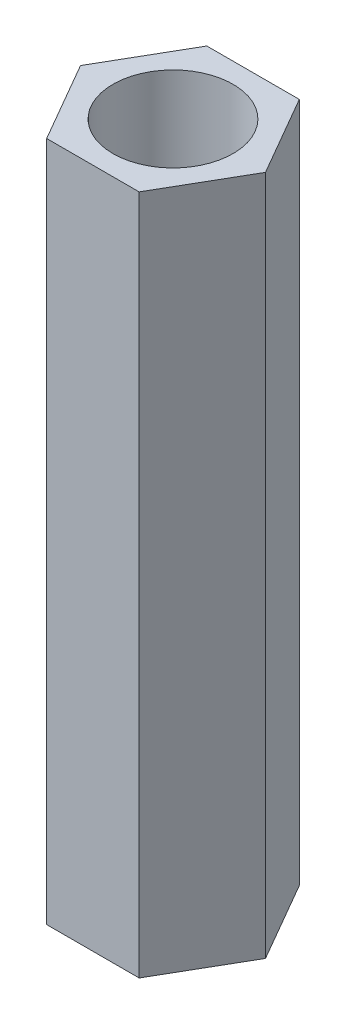
ISO-10303-21;
HEADER;
FILE_DESCRIPTION(('STEP AP214'),'2;1');
FILE_NAME('part.step','',(''),(''),'','','');
FILE_SCHEMA(('AUTOMOTIVE_DESIGN { 1 0 10303 214 1 1 1 1 }'));
ENDSEC;
DATA;
#1=APPLICATION_CONTEXT('core data for automotive mechanical design processes');
#2=APPLICATION_PROTOCOL_DEFINITION('international standard','automotive_design',2000,#1);
#3=PRODUCT_CONTEXT('',#1,'mechanical');
#4=PRODUCT('Part','Part','',(#3));
#5=PRODUCT_RELATED_PRODUCT_CATEGORY('part','',(#4));
#6=PRODUCT_DEFINITION_FORMATION('','',#4);
#7=PRODUCT_DEFINITION_CONTEXT('part definition',#1,'design');
#8=PRODUCT_DEFINITION('design','',#6,#7);
#9=PRODUCT_DEFINITION_SHAPE('','',#8);
#10=(LENGTH_UNIT() NAMED_UNIT(*) SI_UNIT(.MILLI.,.METRE.));
#11=(NAMED_UNIT(*) PLANE_ANGLE_UNIT() SI_UNIT($,.RADIAN.));
#12=(NAMED_UNIT(*) SI_UNIT($,.STERADIAN.) SOLID_ANGLE_UNIT());
#13=UNCERTAINTY_MEASURE_WITH_UNIT(LENGTH_MEASURE(1.E-05),#10,'distance_accuracy_value','');
#14=(GEOMETRIC_REPRESENTATION_CONTEXT(3) GLOBAL_UNCERTAINTY_ASSIGNED_CONTEXT((#13)) GLOBAL_UNIT_ASSIGNED_CONTEXT((#10,
#11,#12)) REPRESENTATION_CONTEXT('',''));
#15=CARTESIAN_POINT('',(0.,0.,0.));
#16=DIRECTION('',(0.,0.,1.));
#17=DIRECTION('',(1.,0.,0.));
#18=AXIS2_PLACEMENT_3D('',#15,#16,#17);
#19=CARTESIAN_POINT('',(0.,8.5,0.));
#20=DIRECTION('',(0.,1.,0.));
#21=DIRECTION('',(0.,0.,1.));
#22=AXIS2_PLACEMENT_3D('',#19,#20,#21);
#23=PLANE('',#22);
#24=DIRECTION('',(-0.5,0.,-0.866025403784438));
#25=VECTOR('',#24,1.);
#26=CARTESIAN_POINT('',(2.3094010767585,8.5,0.));
#27=LINE('',#26,#25);
#28=CARTESIAN_POINT('',(2.3094010767585,8.5,0.));
#29=VERTEX_POINT('',#28);
#30=CARTESIAN_POINT('',(1.15470053837925,8.5,-2.));
#31=VERTEX_POINT('',#30);
#32=EDGE_CURVE('E128',#29,#31,#27,.T.);
#33=ORIENTED_EDGE('',*,*,#32,.T.);
#34=DIRECTION('',(-1.,0.,0.));
#35=VECTOR('',#34,1.);
#36=CARTESIAN_POINT('',(1.15470053837925,8.5,-2.));
#37=LINE('',#36,#35);
#38=CARTESIAN_POINT('',(-1.15470053837925,8.5,-2.));
#39=VERTEX_POINT('',#38);
#40=EDGE_CURVE('E86',#31,#39,#37,.T.);
#41=ORIENTED_EDGE('',*,*,#40,.T.);
#42=DIRECTION('',(-0.5,0.,0.866025403784439));
#43=VECTOR('',#42,1.);
#44=CARTESIAN_POINT('',(-1.15470053837925,8.5,-2.));
#45=LINE('',#44,#43);
#46=CARTESIAN_POINT('',(-2.3094010767585,8.5,0.));
#47=VERTEX_POINT('',#46);
#48=EDGE_CURVE('E99',#39,#47,#45,.T.);
#49=ORIENTED_EDGE('',*,*,#48,.T.);
#50=DIRECTION('',(0.5,0.,0.866025403784438));
#51=VECTOR('',#50,1.);
#52=CARTESIAN_POINT('',(-2.3094010767585,8.5,0.));
#53=LINE('',#52,#51);
#54=CARTESIAN_POINT('',(-1.15470053837925,8.5,2.));
#55=VERTEX_POINT('',#54);
#56=EDGE_CURVE('E93',#47,#55,#53,.T.);
#57=ORIENTED_EDGE('',*,*,#56,.T.);
#58=DIRECTION('',(1.,0.,0.));
#59=VECTOR('',#58,1.);
#60=CARTESIAN_POINT('',(-1.15470053837925,8.5,2.));
#61=LINE('',#60,#59);
#62=CARTESIAN_POINT('',(1.15470053837925,8.5,2.));
#63=VERTEX_POINT('',#62);
#64=EDGE_CURVE('E97',#55,#63,#61,.T.);
#65=ORIENTED_EDGE('',*,*,#64,.T.);
#66=DIRECTION('',(0.5,0.,-0.866025403784439));
#67=VECTOR('',#66,1.);
#68=CARTESIAN_POINT('',(1.15470053837925,8.5,2.));
#69=LINE('',#68,#67);
#70=EDGE_CURVE('E49',#63,#29,#69,.T.);
#71=ORIENTED_EDGE('',*,*,#70,.T.);
#72=EDGE_LOOP('',(#33,#41,#49,#57,#65,#71));
#73=FACE_BOUND('',#72,.T.);
#74=CARTESIAN_POINT('',(0.,8.5,0.));
#75=DIRECTION('',(0.,1.,0.));
#76=DIRECTION('',(0.,0.,1.));
#77=AXIS2_PLACEMENT_3D('',#74,#75,#76);
#78=CIRCLE('',#77,1.5);
#79=CARTESIAN_POINT('',(0.,8.5,1.5));
#80=VERTEX_POINT('',#79);
#81=EDGE_CURVE('E121',#80,#80,#78,.T.);
#82=ORIENTED_EDGE('',*,*,#81,.F.);
#83=EDGE_LOOP('',(#82));
#84=FACE_BOUND('',#83,.T.);
#85=ADVANCED_FACE('F32',(#73,#84),#23,.T.);
#86=CARTESIAN_POINT('',(0.,-8.5,0.));
#87=DIRECTION('',(0.,1.,0.));
#88=DIRECTION('',(0.,0.,1.));
#89=AXIS2_PLACEMENT_3D('',#86,#87,#88);
#90=PLANE('',#89);
#91=DIRECTION('',(-0.5,0.,-0.866025403784438));
#92=VECTOR('',#91,1.);
#93=CARTESIAN_POINT('',(2.3094010767585,-8.5,0.));
#94=LINE('',#93,#92);
#95=CARTESIAN_POINT('',(2.3094010767585,-8.5,0.));
#96=VERTEX_POINT('',#95);
#97=CARTESIAN_POINT('',(1.15470053837925,-8.5,-2.));
#98=VERTEX_POINT('',#97);
#99=EDGE_CURVE('E117',#96,#98,#94,.T.);
#100=ORIENTED_EDGE('',*,*,#99,.F.);
#101=DIRECTION('',(0.5,0.,-0.866025403784439));
#102=VECTOR('',#101,1.);
#103=CARTESIAN_POINT('',(1.15470053837925,-8.5,2.));
#104=LINE('',#103,#102);
#105=CARTESIAN_POINT('',(1.15470053837925,-8.5,2.));
#106=VERTEX_POINT('',#105);
#107=EDGE_CURVE('E78',#106,#96,#104,.T.);
#108=ORIENTED_EDGE('',*,*,#107,.F.);
#109=DIRECTION('',(1.,0.,0.));
#110=VECTOR('',#109,1.);
#111=CARTESIAN_POINT('',(-1.15470053837925,-8.5,2.));
#112=LINE('',#111,#110);
#113=CARTESIAN_POINT('',(-1.15470053837925,-8.5,2.));
#114=VERTEX_POINT('',#113);
#115=EDGE_CURVE('E72',#114,#106,#112,.T.);
#116=ORIENTED_EDGE('',*,*,#115,.F.);
#117=DIRECTION('',(0.5,0.,0.866025403784438));
#118=VECTOR('',#117,1.);
#119=CARTESIAN_POINT('',(-2.3094010767585,-8.5,0.));
#120=LINE('',#119,#118);
#121=CARTESIAN_POINT('',(-2.3094010767585,-8.5,0.));
#122=VERTEX_POINT('',#121);
#123=EDGE_CURVE('E107',#122,#114,#120,.T.);
#124=ORIENTED_EDGE('',*,*,#123,.F.);
#125=DIRECTION('',(-0.5,0.,0.866025403784439));
#126=VECTOR('',#125,1.);
#127=CARTESIAN_POINT('',(-1.15470053837925,-8.5,-2.));
#128=LINE('',#127,#126);
#129=CARTESIAN_POINT('',(-1.15470053837925,-8.5,-2.));
#130=VERTEX_POINT('',#129);
#131=EDGE_CURVE('E123',#130,#122,#128,.T.);
#132=ORIENTED_EDGE('',*,*,#131,.F.);
#133=DIRECTION('',(-1.,0.,0.));
#134=VECTOR('',#133,1.);
#135=CARTESIAN_POINT('',(1.15470053837925,-8.5,-2.));
#136=LINE('',#135,#134);
#137=EDGE_CURVE('E120',#98,#130,#136,.T.);
#138=ORIENTED_EDGE('',*,*,#137,.F.);
#139=EDGE_LOOP('',(#100,#108,#116,#124,#132,#138));
#140=FACE_BOUND('',#139,.T.);
#141=CARTESIAN_POINT('',(0.,-8.5,0.));
#142=DIRECTION('',(0.,1.,0.));
#143=DIRECTION('',(0.,0.,1.));
#144=AXIS2_PLACEMENT_3D('',#141,#142,#143);
#145=CIRCLE('',#144,1.5);
#146=CARTESIAN_POINT('',(0.,-8.5,1.5));
#147=VERTEX_POINT('',#146);
#148=EDGE_CURVE('E221',#147,#147,#145,.T.);
#149=ORIENTED_EDGE('',*,*,#148,.T.);
#150=EDGE_LOOP('',(#149));
#151=FACE_BOUND('',#150,.T.);
#152=ADVANCED_FACE('F137',(#140,#151),#90,.F.);
#153=CARTESIAN_POINT('',(2.3094010767585,8.5,0.));
#154=DIRECTION('',(-0.866025403784439,0.,0.5));
#155=DIRECTION('',(0.5,0.,0.866025403784438));
#156=AXIS2_PLACEMENT_3D('',#153,#154,#155);
#157=PLANE('',#156);
#158=ORIENTED_EDGE('',*,*,#99,.T.);
#159=DIRECTION('',(0.,-1.,0.));
#160=VECTOR('',#159,1.);
#161=CARTESIAN_POINT('',(1.15470053837925,8.5,-2.));
#162=LINE('',#161,#160);
#163=EDGE_CURVE('E11',#31,#98,#162,.T.);
#164=ORIENTED_EDGE('',*,*,#163,.F.);
#165=ORIENTED_EDGE('',*,*,#32,.F.);
#166=DIRECTION('',(0.,-1.,0.));
#167=VECTOR('',#166,1.);
#168=CARTESIAN_POINT('',(2.3094010767585,8.5,0.));
#169=LINE('',#168,#167);
#170=EDGE_CURVE('E113',#29,#96,#169,.T.);
#171=ORIENTED_EDGE('',*,*,#170,.T.);
#172=EDGE_LOOP('',(#158,#164,#165,#171));
#173=FACE_BOUND('',#172,.T.);
#174=ADVANCED_FACE('F34',(#173),#157,.F.);
#175=CARTESIAN_POINT('',(1.15470053837925,8.5,-2.));
#176=DIRECTION('',(0.,0.,1.));
#177=DIRECTION('',(1.,0.,0.));
#178=AXIS2_PLACEMENT_3D('',#175,#176,#177);
#179=PLANE('',#178);
#180=ORIENTED_EDGE('',*,*,#137,.T.);
#181=DIRECTION('',(0.,-1.,0.));
#182=VECTOR('',#181,1.);
#183=CARTESIAN_POINT('',(-1.15470053837925,8.5,-2.));
#184=LINE('',#183,#182);
#185=EDGE_CURVE('E41',#39,#130,#184,.T.);
#186=ORIENTED_EDGE('',*,*,#185,.F.);
#187=ORIENTED_EDGE('',*,*,#40,.F.);
#188=ORIENTED_EDGE('',*,*,#163,.T.);
#189=EDGE_LOOP('',(#180,#186,#187,#188));
#190=FACE_BOUND('',#189,.T.);
#191=ADVANCED_FACE('F162',(#190),#179,.F.);
#192=CARTESIAN_POINT('',(-1.15470053837925,8.5,-2.));
#193=DIRECTION('',(0.866025403784439,0.,0.5));
#194=DIRECTION('',(0.5,0.,-0.866025403784439));
#195=AXIS2_PLACEMENT_3D('',#192,#193,#194);
#196=PLANE('',#195);
#197=ORIENTED_EDGE('',*,*,#131,.T.);
#198=DIRECTION('',(0.,-1.,0.));
#199=VECTOR('',#198,1.);
#200=CARTESIAN_POINT('',(-2.3094010767585,8.5,0.));
#201=LINE('',#200,#199);
#202=EDGE_CURVE('E108',#47,#122,#201,.T.);
#203=ORIENTED_EDGE('',*,*,#202,.F.);
#204=ORIENTED_EDGE('',*,*,#48,.F.);
#205=ORIENTED_EDGE('',*,*,#185,.T.);
#206=EDGE_LOOP('',(#197,#203,#204,#205));
#207=FACE_BOUND('',#206,.T.);
#208=ADVANCED_FACE('F134',(#207),#196,.F.);
#209=CARTESIAN_POINT('',(-2.3094010767585,8.5,0.));
#210=DIRECTION('',(0.866025403784438,0.,-0.5));
#211=DIRECTION('',(-0.5,0.,-0.866025403784438));
#212=AXIS2_PLACEMENT_3D('',#209,#210,#211);
#213=PLANE('',#212);
#214=ORIENTED_EDGE('',*,*,#123,.T.);
#215=DIRECTION('',(0.,-1.,0.));
#216=VECTOR('',#215,1.);
#217=CARTESIAN_POINT('',(-1.15470053837925,8.5,2.));
#218=LINE('',#217,#216);
#219=EDGE_CURVE('E104',#55,#114,#218,.T.);
#220=ORIENTED_EDGE('',*,*,#219,.F.);
#221=ORIENTED_EDGE('',*,*,#56,.F.);
#222=ORIENTED_EDGE('',*,*,#202,.T.);
#223=EDGE_LOOP('',(#214,#220,#221,#222));
#224=FACE_BOUND('',#223,.T.);
#225=ADVANCED_FACE('F105',(#224),#213,.F.);
#226=CARTESIAN_POINT('',(-1.15470053837925,8.5,2.));
#227=DIRECTION('',(0.,0.,-1.));
#228=DIRECTION('',(-1.,0.,0.));
#229=AXIS2_PLACEMENT_3D('',#226,#227,#228);
#230=PLANE('',#229);
#231=ORIENTED_EDGE('',*,*,#115,.T.);
#232=DIRECTION('',(0.,-1.,0.));
#233=VECTOR('',#232,1.);
#234=CARTESIAN_POINT('',(1.15470053837925,8.5,2.));
#235=LINE('',#234,#233);
#236=EDGE_CURVE('E109',#63,#106,#235,.T.);
#237=ORIENTED_EDGE('',*,*,#236,.F.);
#238=ORIENTED_EDGE('',*,*,#64,.F.);
#239=ORIENTED_EDGE('',*,*,#219,.T.);
#240=EDGE_LOOP('',(#231,#237,#238,#239));
#241=FACE_BOUND('',#240,.T.);
#242=ADVANCED_FACE('F111',(#241),#230,.F.);
#243=CARTESIAN_POINT('',(1.15470053837925,8.5,2.));
#244=DIRECTION('',(-0.866025403784439,0.,-0.5));
#245=DIRECTION('',(-0.5,0.,0.866025403784439));
#246=AXIS2_PLACEMENT_3D('',#243,#244,#245);
#247=PLANE('',#246);
#248=ORIENTED_EDGE('',*,*,#107,.T.);
#249=ORIENTED_EDGE('',*,*,#170,.F.);
#250=ORIENTED_EDGE('',*,*,#70,.F.);
#251=ORIENTED_EDGE('',*,*,#236,.T.);
#252=EDGE_LOOP('',(#248,#249,#250,#251));
#253=FACE_BOUND('',#252,.T.);
#254=ADVANCED_FACE('F142',(#253),#247,.F.);
#255=CARTESIAN_POINT('',(0.,8.5,0.));
#256=DIRECTION('',(0.,-1.,0.));
#257=DIRECTION('',(0.,0.,-1.));
#258=AXIS2_PLACEMENT_3D('',#255,#256,#257);
#259=CYLINDRICAL_SURFACE('',#258,1.5);
#260=ORIENTED_EDGE('',*,*,#81,.T.);
#261=EDGE_LOOP('',(#260));
#262=FACE_BOUND('',#261,.T.);
#263=ORIENTED_EDGE('',*,*,#148,.F.);
#264=EDGE_LOOP('',(#263));
#265=FACE_BOUND('',#264,.T.);
#266=ADVANCED_FACE('F144',(#262,#265),#259,.F.);
#267=CLOSED_SHELL('',(#85,#152,#174,#191,#208,#225,#242,#254,#266));
#268=MANIFOLD_SOLID_BREP('B2',#267);
#269=ADVANCED_BREP_SHAPE_REPRESENTATION('',(#18,#268),#14);
#270=SHAPE_DEFINITION_REPRESENTATION(#9,#269);
ENDSEC;
END-ISO-10303-21;
